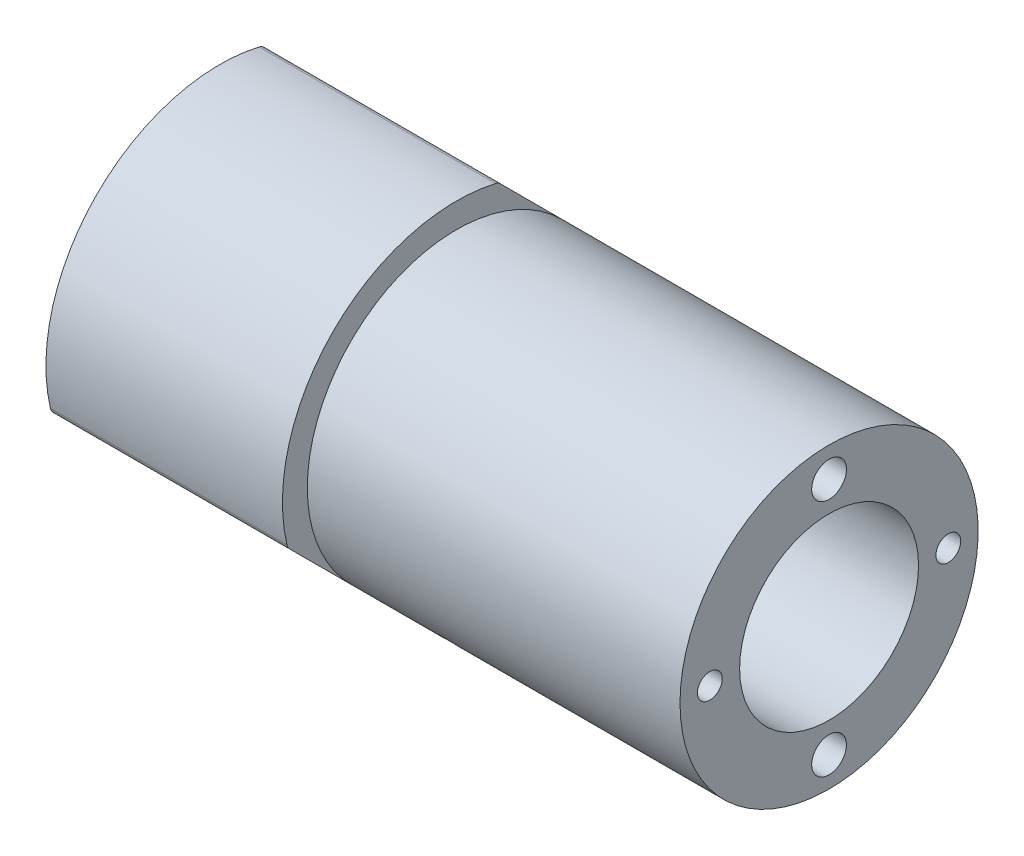
ISO-10303-21;
HEADER;
FILE_DESCRIPTION(('STEP AP214'),'2;1');
FILE_NAME('part.step','',(''),(''),'','','');
FILE_SCHEMA(('AUTOMOTIVE_DESIGN { 1 0 10303 214 1 1 1 1 }'));
ENDSEC;
DATA;
#1=APPLICATION_CONTEXT('core data for automotive mechanical design processes');
#2=APPLICATION_PROTOCOL_DEFINITION('international standard','automotive_design',2000,#1);
#3=PRODUCT_CONTEXT('',#1,'mechanical');
#4=PRODUCT('Part','Part','',(#3));
#5=PRODUCT_RELATED_PRODUCT_CATEGORY('part','',(#4));
#6=PRODUCT_DEFINITION_FORMATION('','',#4);
#7=PRODUCT_DEFINITION_CONTEXT('part definition',#1,'design');
#8=PRODUCT_DEFINITION('design','',#6,#7);
#9=PRODUCT_DEFINITION_SHAPE('','',#8);
#10=(LENGTH_UNIT() NAMED_UNIT(*) SI_UNIT(.MILLI.,.METRE.));
#11=(NAMED_UNIT(*) PLANE_ANGLE_UNIT() SI_UNIT($,.RADIAN.));
#12=(NAMED_UNIT(*) SI_UNIT($,.STERADIAN.) SOLID_ANGLE_UNIT());
#13=UNCERTAINTY_MEASURE_WITH_UNIT(LENGTH_MEASURE(1.E-05),#10,'distance_accuracy_value','');
#14=(GEOMETRIC_REPRESENTATION_CONTEXT(3) GLOBAL_UNCERTAINTY_ASSIGNED_CONTEXT((#13)) GLOBAL_UNIT_ASSIGNED_CONTEXT((#10,
#11,#12)) REPRESENTATION_CONTEXT('',''));
#15=CARTESIAN_POINT('',(0.,0.,0.));
#16=DIRECTION('',(0.,0.,1.));
#17=DIRECTION('',(1.,0.,0.));
#18=AXIS2_PLACEMENT_3D('',#15,#16,#17);
#19=CARTESIAN_POINT('',(227.370475165962,-148.573704322227,0.));
#20=DIRECTION('',(-1.,0.,0.));
#21=DIRECTION('',(0.,0.,1.));
#22=AXIS2_PLACEMENT_3D('',#19,#20,#21);
#23=CYLINDRICAL_SURFACE('',#22,9.00000000000001);
#24=CARTESIAN_POINT('',(259.301545348096,-148.573704322227,0.));
#25=DIRECTION('',(-1.,0.,0.));
#26=DIRECTION('',(0.,0.,1.));
#27=AXIS2_PLACEMENT_3D('',#24,#25,#26);
#28=CIRCLE('',#27,9.00000000000001);
#29=CARTESIAN_POINT('',(259.301545348096,-148.573704322227,9.00000000000001));
#30=VERTEX_POINT('',#29);
#31=EDGE_CURVE('E147',#30,#30,#28,.T.);
#32=ORIENTED_EDGE('',*,*,#31,.F.);
#33=EDGE_LOOP('',(#32));
#34=FACE_BOUND('',#33,.T.);
#35=CARTESIAN_POINT('',(208.551545348096,-148.573704322227,0.));
#36=DIRECTION('',(-1.,0.,0.));
#37=DIRECTION('',(0.,0.,1.));
#38=AXIS2_PLACEMENT_3D('',#35,#36,#37);
#39=CIRCLE('',#38,9.00000000000001);
#40=CARTESIAN_POINT('',(208.551545348096,-148.573704322227,9.00000000000001));
#41=VERTEX_POINT('',#40);
#42=EDGE_CURVE('E155',#41,#41,#39,.T.);
#43=ORIENTED_EDGE('',*,*,#42,.T.);
#44=EDGE_LOOP('',(#43));
#45=FACE_BOUND('',#44,.T.);
#46=CARTESIAN_POINT('',(231.801545348096,-155.60536642375,5.61744853915024));
#47=CARTESIAN_POINT('',(231.745561234619,-155.60536523312,5.61745075321373));
#48=CARTESIAN_POINT('',(231.689540948331,-155.602406556977,5.62115976932162));
#49=CARTESIAN_POINT('',(231.579056004039,-155.590618313197,5.63586758532295));
#50=CARTESIAN_POINT('',(231.524593089471,-155.581782415386,5.64687424524178));
#51=CARTESIAN_POINT('',(231.418838729071,-155.558409287387,5.67575894167251));
#52=CARTESIAN_POINT('',(231.367545288797,-155.543875685745,5.69363260483115));
#53=CARTESIAN_POINT('',(231.269542832449,-155.509386558681,5.73559465066902));
#54=CARTESIAN_POINT('',(231.222832961176,-155.489432047314,5.75968187097278));
#55=CARTESIAN_POINT('',(231.135105099005,-155.444398469707,5.81332862511097));
#56=CARTESIAN_POINT('',(231.094110434917,-155.419299378518,5.84290949904011));
#57=CARTESIAN_POINT('',(231.019177821142,-155.364538655035,5.90646467656285));
#58=CARTESIAN_POINT('',(230.985240205875,-155.334876806636,5.94043918823749));
#59=CARTESIAN_POINT('',(230.925302976794,-155.271555116257,6.01174439417106));
#60=CARTESIAN_POINT('',(230.899324229479,-155.237885080822,6.04908358416143));
#61=CARTESIAN_POINT('',(230.856175729996,-155.167405623669,6.12583174544058));
#62=CARTESIAN_POINT('',(230.83900571643,-155.130596295145,6.16524065527231));
#63=CARTESIAN_POINT('',(230.814031101485,-155.054936639023,6.24472771980938));
#64=CARTESIAN_POINT('',(230.806187952201,-155.016095409707,6.28480242089628));
#65=CARTESIAN_POINT('',(230.799970349444,-154.937292011474,6.36458126251163));
#66=CARTESIAN_POINT('',(230.801595597386,-154.897329877944,6.40428541468571));
#67=CARTESIAN_POINT('',(230.814237530487,-154.817617429417,6.48202406499678));
#68=CARTESIAN_POINT('',(230.825212762772,-154.777866957564,6.520065154843));
#69=CARTESIAN_POINT('',(230.856178447359,-154.699594755693,6.59366014809663));
#70=CARTESIAN_POINT('',(230.876169039929,-154.661073044803,6.62921401279619));
#71=CARTESIAN_POINT('',(230.924642863704,-154.586379271311,6.6970361412464));
#72=CARTESIAN_POINT('',(230.953144269252,-154.550212440785,6.72929717350871));
#73=CARTESIAN_POINT('',(231.017817463439,-154.481486493677,6.78971330449449));
#74=CARTESIAN_POINT('',(231.053989530077,-154.448927507914,6.81786825434407));
#75=CARTESIAN_POINT('',(231.133209989639,-154.388339860472,6.86961519220139));
#76=CARTESIAN_POINT('',(231.176294471368,-154.360336620559,6.89318171064714));
#77=CARTESIAN_POINT('',(231.267992110438,-154.310051556786,6.93508436603064));
#78=CARTESIAN_POINT('',(231.316605279214,-154.287769744759,6.95342049215116));
#79=CARTESIAN_POINT('',(231.418009834831,-154.249726793658,6.98450969025567));
#80=CARTESIAN_POINT('',(231.470802435655,-154.233967557513,6.99726113299871));
#81=CARTESIAN_POINT('',(231.579052355975,-154.209568609816,7.01692821180988));
#82=CARTESIAN_POINT('',(231.634509574649,-154.200928629121,7.02384406849225));
#83=CARTESIAN_POINT('',(231.746197794613,-154.191124030995,7.03168797246607));
#84=CARTESIAN_POINT('',(231.802423090392,-154.189919784123,7.03264776330683));
#85=CARTESIAN_POINT('',(231.914329261611,-154.19492688994,7.02864615072725));
#86=CARTESIAN_POINT('',(231.970010146155,-154.201138118418,7.02368484648715));
#87=CARTESIAN_POINT('',(232.079098090765,-154.220713655972,7.00795554659682));
#88=CARTESIAN_POINT('',(232.132510734434,-154.234059150897,6.99720282324517));
#89=CARTESIAN_POINT('',(232.235720033688,-154.267396228258,6.97010267030142));
#90=CARTESIAN_POINT('',(232.28551658773,-154.287387997239,6.95375508367391));
#91=CARTESIAN_POINT('',(232.380309494692,-154.333394760571,6.91569647154002));
#92=CARTESIAN_POINT('',(232.425284851565,-154.359434651327,6.89396325123847));
#93=CARTESIAN_POINT('',(232.508945216713,-154.416579084981,6.84559800884551));
#94=CARTESIAN_POINT('',(232.547630032307,-154.447683782957,6.81896583675064));
#95=CARTESIAN_POINT('',(232.617786590756,-154.514053654835,6.76122691475741));
#96=CARTESIAN_POINT('',(232.649225309735,-154.549336808923,6.73010069087644));
#97=CARTESIAN_POINT('',(232.703769476509,-154.622783957855,6.66416294608429));
#98=CARTESIAN_POINT('',(232.726875061415,-154.660947905288,6.62935148582086));
#99=CARTESIAN_POINT('',(232.764041712544,-154.738848803926,6.55696667863553));
#100=CARTESIAN_POINT('',(232.778122364099,-154.778582148875,6.51939951092606));
#101=CARTESIAN_POINT('',(232.796903288829,-154.858473553382,6.4424181228707));
#102=CARTESIAN_POINT('',(232.801603891946,-154.898631597952,6.40300396754194));
#103=CARTESIAN_POINT('',(232.801486016229,-154.977972268744,6.32364480901438));
#104=CARTESIAN_POINT('',(232.796718657309,-155.01715898285,6.28370380696488));
#105=CARTESIAN_POINT('',(232.777907829705,-155.093697403984,6.20425129508041));
#106=CARTESIAN_POINT('',(232.763864358863,-155.131049110584,6.16473978534545));
#107=CARTESIAN_POINT('',(232.726914926077,-155.20294531167,6.08736026010714));
#108=CARTESIAN_POINT('',(232.704010866684,-155.237490406868,6.04949189372723));
#109=CARTESIAN_POINT('',(232.649995756113,-155.30295711022,5.97658434740529));
#110=CARTESIAN_POINT('',(232.618884691455,-155.333878712423,5.94154517211039));
#111=CARTESIAN_POINT('',(232.549147899887,-155.391564335877,5.87526411868229));
#112=CARTESIAN_POINT('',(232.510484082397,-155.418305991522,5.84404285039469));
#113=CARTESIAN_POINT('',(232.426816683556,-155.46688487017,5.78666391032697));
#114=CARTESIAN_POINT('',(232.381811592129,-155.488720921755,5.76050744818525));
#115=CARTESIAN_POINT('',(232.286583758259,-155.527105673619,5.71411601254217));
#116=CARTESIAN_POINT('',(232.236345373767,-155.543637883224,5.6938995236583));
#117=CARTESIAN_POINT('',(232.132219629674,-155.570988472521,5.66025519704447));
#118=CARTESIAN_POINT('',(232.078336400461,-155.581813201558,5.64681981631628));
#119=CARTESIAN_POINT('',(231.987056410623,-155.594901647346,5.63052869919481));
#120=CARTESIAN_POINT('',(231.950240166936,-155.598822145224,5.62563217222459));
#121=CARTESIAN_POINT('',(231.876136416561,-155.604054922913,5.61909136352117));
#122=CARTESIAN_POINT('',(231.838848912472,-155.605367217096,5.61744706386637));
#123=CARTESIAN_POINT('',(231.801545348096,-155.60536642375,5.61744853915024));
#124=B_SPLINE_CURVE_WITH_KNOTS('',3,(#46,#47,#48,#49,#50,#51,#52,#53,#54,#55,#56,#57,#58,#59,
#60,#61,#62,#63,#64,#65,#66,#67,#68,#69,#70,#71,#72,#73,#74,#75,#76,#77,#78,#79,#80,#81,#82,#83,
#84,#85,#86,#87,#88,#89,#90,#91,#92,#93,#94,#95,#96,#97,#98,#99,#100,#101,#102,#103,#104,#105,
#106,#107,#108,#109,#110,#111,#112,#113,#114,#115,#116,#117,#118,#119,#120,#121,#122,#123),
.UNSPECIFIED.,.T.,.F.,(4,2,2,2,2,2,2,2,2,2,2,2,2,2,2,2,2,2,2,2,2,2,2,2,2,2,2,2,2,2,2,2,2,2,2,2,
2,2,4),(0.,0.167816094312495,0.335813231467333,0.503703554025065,0.671562491943652,
0.840087659677699,1.00862081162628,1.17759211396055,1.34655840179298,1.5148238980698,
1.68308408815946,1.85060216087686,2.01812284004198,2.1860038396258,2.35389092454429,
2.52268489532749,2.69147921519916,2.86032274533259,3.02915989205334,3.19709642315279,
3.36503014130096,3.53252316164427,3.70002088353093,3.86822070886242,4.03642568524667,
4.2053827266527,4.37433698797284,4.54292334295312,4.71150376785723,4.8791764590021,
5.04684918918841,5.21448593656708,5.38212295929422,5.55062832814458,5.71917389198528,
5.88823852910648,6.05711468959692,6.1689352148479,6.28075512390305),.UNSPECIFIED.);
#125=CARTESIAN_POINT('',(231.801545348096,-155.60536642375,5.61744853915024));
#126=VERTEX_POINT('',#125);
#127=EDGE_CURVE('E133',#126,#126,#124,.T.);
#128=ORIENTED_EDGE('',*,*,#127,.F.);
#129=EDGE_LOOP('',(#128));
#130=FACE_BOUND('',#129,.T.);
#131=ADVANCED_FACE('F36',(#34,#45,#130),#23,.F.);
#132=CARTESIAN_POINT('',(227.370475165962,-148.573704322227,0.));
#133=DIRECTION('',(-1.,0.,0.));
#134=DIRECTION('',(0.,0.,1.));
#135=AXIS2_PLACEMENT_3D('',#132,#133,#134);
#136=CYLINDRICAL_SURFACE('',#135,15.);
#137=CARTESIAN_POINT('',(221.801545348096,-148.573704322227,0.));
#138=DIRECTION('',(-1.,0.,0.));
#139=DIRECTION('',(0.,0.,1.));
#140=AXIS2_PLACEMENT_3D('',#137,#138,#139);
#141=CIRCLE('',#140,15.);
#142=CARTESIAN_POINT('',(221.801545348096,-137.967102604429,-10.6066017177982));
#143=VERTEX_POINT('',#142);
#144=CARTESIAN_POINT('',(221.801545348096,-159.180306040025,10.6066017177983));
#145=VERTEX_POINT('',#144);
#146=EDGE_CURVE('E124',#143,#145,#141,.T.);
#147=ORIENTED_EDGE('',*,*,#146,.F.);
#148=EDGE_CURVE('E135',#145,#143,#141,.T.);
#149=ORIENTED_EDGE('',*,*,#148,.F.);
#150=EDGE_LOOP('',(#147,#149));
#151=FACE_BOUND('',#150,.T.);
#152=CARTESIAN_POINT('',(259.301545348096,-148.573704322227,0.));
#153=DIRECTION('',(-1.,0.,0.));
#154=DIRECTION('',(0.,0.,1.));
#155=AXIS2_PLACEMENT_3D('',#152,#153,#154);
#156=CIRCLE('',#155,15.);
#157=CARTESIAN_POINT('',(259.301545348096,-148.573704322227,15.));
#158=VERTEX_POINT('',#157);
#159=EDGE_CURVE('E145',#158,#158,#156,.T.);
#160=ORIENTED_EDGE('',*,*,#159,.T.);
#161=EDGE_LOOP('',(#160));
#162=FACE_BOUND('',#161,.T.);
#163=CARTESIAN_POINT('',(231.801545348096,-159.863816347672,9.87589846307187));
#164=CARTESIAN_POINT('',(231.857648782675,-159.863814919316,9.87590052172793));
#165=CARTESIAN_POINT('',(231.913791308216,-159.860692061514,9.87947367749882));
#166=CARTESIAN_POINT('',(232.024525566104,-159.848260834343,9.8936576125694));
#167=CARTESIAN_POINT('',(232.079115425381,-159.83894529911,9.90427654487056));
#168=CARTESIAN_POINT('',(232.185124357026,-159.81434249053,9.93218997274158));
#169=CARTESIAN_POINT('',(232.236545108031,-159.799058410678,9.94948089837368));
#170=CARTESIAN_POINT('',(232.334777158524,-159.762873127476,9.99015709858705));
#171=CARTESIAN_POINT('',(232.381589497764,-159.741973195165,10.0135409941064));
#172=CARTESIAN_POINT('',(232.469368310265,-159.695006253977,10.065677948239));
#173=CARTESIAN_POINT('',(232.510325945678,-159.668931572446,10.0944389758679));
#174=CARTESIAN_POINT('',(232.585157013398,-159.61225694805,10.1563829432925));
#175=CARTESIAN_POINT('',(232.619030147775,-159.581656814964,10.189566068959));
#176=CARTESIAN_POINT('',(232.678758273044,-159.516656703301,10.2593403863135));
#177=CARTESIAN_POINT('',(232.704605890015,-159.482253269333,10.2959346723118));
#178=CARTESIAN_POINT('',(232.747502058877,-159.410552186902,10.3713756872603));
#179=CARTESIAN_POINT('',(232.764550715526,-159.373254572903,10.4102223893872));
#180=CARTESIAN_POINT('',(232.78934032389,-159.296818142623,10.4889386295473));
#181=CARTESIAN_POINT('',(232.79709520347,-159.25768217305,10.5288065453469));
#182=CARTESIAN_POINT('',(232.803120144596,-159.178600543232,10.6084553576025));
#183=CARTESIAN_POINT('',(232.80139032538,-159.138654893174,10.648236255146));
#184=CARTESIAN_POINT('',(232.78850644284,-159.059161986195,10.7265225305829));
#185=CARTESIAN_POINT('',(232.777367360678,-159.019614197041,10.7650298350368));
#186=CARTESIAN_POINT('',(232.746004406274,-158.942016730764,10.8397879318341));
#187=CARTESIAN_POINT('',(232.72578047443,-158.903967063472,10.8760387093717));
#188=CARTESIAN_POINT('',(232.67680498715,-158.830486501923,10.9453632031899));
#189=CARTESIAN_POINT('',(232.64804665669,-158.79505771627,10.9784343676177));
#190=CARTESIAN_POINT('',(232.582823642301,-158.727949225982,11.040534591177));
#191=CARTESIAN_POINT('',(232.546358859304,-158.696269569551,11.0695635983376));
#192=CARTESIAN_POINT('',(232.466673461717,-158.637605212215,11.1229257822552));
#193=CARTESIAN_POINT('',(232.423439841458,-158.61062976541,11.1472497132431));
#194=CARTESIAN_POINT('',(232.331489535526,-158.562325313206,11.190554342132));
#195=CARTESIAN_POINT('',(232.282772847334,-158.5409963104,11.2095350375784));
#196=CARTESIAN_POINT('',(232.181230824317,-158.50469009055,11.2417130864283));
#197=CARTESIAN_POINT('',(232.12840521511,-158.48971329812,11.2549100532192));
#198=CARTESIAN_POINT('',(232.020148787993,-158.46661885872,11.2752153189393));
#199=CARTESIAN_POINT('',(231.96471800499,-158.458501119874,11.2823236994248));
#200=CARTESIAN_POINT('',(231.852938877459,-158.449410335787,11.2902820129301));
#201=CARTESIAN_POINT('',(231.796592503437,-158.448423574674,11.2911439604799));
#202=CARTESIAN_POINT('',(231.684481309733,-158.453592170793,11.2866216129746));
#203=CARTESIAN_POINT('',(231.628716486605,-158.459747485664,11.2812373549674));
#204=CARTESIAN_POINT('',(231.519402941885,-158.478981535308,11.2643528514879));
#205=CARTESIAN_POINT('',(231.465852249382,-158.492053963239,11.2528581772886));
#206=CARTESIAN_POINT('',(231.362426201206,-158.524678326669,11.224018337837));
#207=CARTESIAN_POINT('',(231.312550883455,-158.544230329012,11.2066731122305));
#208=CARTESIAN_POINT('',(231.217807844042,-158.589200697391,11.1665007649795));
#209=CARTESIAN_POINT('',(231.172947876672,-158.614627966092,11.1436653219775));
#210=CARTESIAN_POINT('',(231.08958710743,-158.670504306139,11.0930630141252));
#211=CARTESIAN_POINT('',(231.051086376145,-158.70095343322,11.0652960945427));
#212=CARTESIAN_POINT('',(230.981475402656,-158.7659540069,11.0054530700411));
#213=CARTESIAN_POINT('',(230.950376942498,-158.800511863928,10.9733702208917));
#214=CARTESIAN_POINT('',(230.896533943612,-158.872609195292,10.9057323627934));
#215=CARTESIAN_POINT('',(230.873789347618,-158.910148649187,10.8701773776491));
#216=CARTESIAN_POINT('',(230.837320161063,-158.987028650859,10.7965505881795));
#217=CARTESIAN_POINT('',(230.823588144129,-159.026367687111,10.7584808845303));
#218=CARTESIAN_POINT('',(230.805509619114,-159.105702895424,10.6808279509854));
#219=CARTESIAN_POINT('',(230.801163003604,-159.145699059959,10.6412447384194));
#220=CARTESIAN_POINT('',(230.801979739182,-159.225113393356,10.5617534169641));
#221=CARTESIAN_POINT('',(230.807124665644,-159.264532532629,10.5218460869282));
#222=CARTESIAN_POINT('',(230.826740198805,-159.341773137813,10.4427845663461));
#223=CARTESIAN_POINT('',(230.841210821357,-159.379594601008,10.4036303770803));
#224=CARTESIAN_POINT('',(230.879062715478,-159.452623942016,10.3272407976396));
#225=CARTESIAN_POINT('',(230.902443860703,-159.487831856877,10.2900053802668));
#226=CARTESIAN_POINT('',(230.957450653349,-159.554725942521,10.2185890007295));
#227=CARTESIAN_POINT('',(230.989076101832,-159.586412198256,10.1844079648883));
#228=CARTESIAN_POINT('',(231.059742198605,-159.645531728681,10.1201063453899));
#229=CARTESIAN_POINT('',(231.098796252623,-159.672957149121,10.0899932734723));
#230=CARTESIAN_POINT('',(231.18319130985,-159.722830750991,10.0348575458179));
#231=CARTESIAN_POINT('',(231.228533846359,-159.745277715062,10.0098361352459));
#232=CARTESIAN_POINT('',(231.324276881557,-159.784684588279,9.96568117261271));
#233=CARTESIAN_POINT('',(231.374684129981,-159.801637044357,9.94655561973676));
#234=CARTESIAN_POINT('',(231.479040445631,-159.829606018268,9.91489422342326));
#235=CARTESIAN_POINT('',(231.532985294873,-159.840629466083,9.90235068717121));
#236=CARTESIAN_POINT('',(231.622972688049,-159.85363872875,9.88752419846842));
#237=CARTESIAN_POINT('',(231.658434035548,-159.857451242859,9.88317107959203));
#238=CARTESIAN_POINT('',(231.729773371586,-159.862540507201,9.87735755567225));
#239=CARTESIAN_POINT('',(231.765651359456,-159.863817261509,9.87589714598));
#240=CARTESIAN_POINT('',(231.801545348096,-159.863816347672,9.87589846307187));
#241=B_SPLINE_CURVE_WITH_KNOTS('',3,(#163,#164,#165,#166,#167,#168,#169,#170,#171,#172,#173,
#174,#175,#176,#177,#178,#179,#180,#181,#182,#183,#184,#185,#186,#187,#188,#189,#190,#191,#192,
#193,#194,#195,#196,#197,#198,#199,#200,#201,#202,#203,#204,#205,#206,#207,#208,#209,#210,#211,
#212,#213,#214,#215,#216,#217,#218,#219,#220,#221,#222,#223,#224,#225,#226,#227,#228,#229,#230,
#231,#232,#233,#234,#235,#236,#237,#238,#239,#240),.UNSPECIFIED.,.T.,.F.,(4,2,2,2,2,2,2,2,2,2,2,
2,2,2,2,2,2,2,2,2,2,2,2,2,2,2,2,2,2,2,2,2,2,2,2,2,2,2,4),(0.,0.16817926484095,0.336553478053452,
0.504837725074759,0.673083916253139,0.841581457072487,1.01008608245695,1.1787450764179,
1.34740206229269,1.51580597764018,1.68420777586517,1.85234195379501,2.02047723479458,
2.18874634851119,2.35701762550342,2.52561627976711,2.6942150114844,2.86282501143769,
3.03143275283048,3.19971610400743,3.36799845705999,3.53612763840645,3.70425855422667,
3.87264592558118,4.04103516590926,4.20969066206903,4.37834500202404,4.54686019555955,
4.71537346017785,4.88355995728438,5.05174674029588,5.21993113867105,5.38811147907858,
5.55659824911517,5.72512617317098,5.89388175069686,6.06243965122597,6.17003795369026,
6.27763608323366),.UNSPECIFIED.);
#242=CARTESIAN_POINT('',(231.801545348096,-159.863816347672,9.87589846307187));
#243=VERTEX_POINT('',#242);
#244=EDGE_CURVE('E336',#243,#243,#241,.T.);
#245=ORIENTED_EDGE('',*,*,#244,.F.);
#246=EDGE_LOOP('',(#245));
#247=FACE_BOUND('',#246,.T.);
#248=ADVANCED_FACE('F143',(#151,#162,#247),#136,.T.);
#249=CARTESIAN_POINT('',(221.801545348096,0.,0.));
#250=DIRECTION('',(1.,0.,0.));
#251=DIRECTION('',(0.,0.,-1.));
#252=AXIS2_PLACEMENT_3D('',#249,#250,#251);
#253=PLANE('',#252);
#254=DIRECTION('',(0.,-0.707106781186551,-0.707106781186544));
#255=VECTOR('',#254,1.);
#256=CARTESIAN_POINT('',(221.801545348096,-165.554080432016,4.23282732580721));
#257=LINE('',#256,#255);
#258=CARTESIAN_POINT('',(221.801545348096,-165.354850557639,4.43205720018408));
#259=VERTEX_POINT('',#258);
#260=EDGE_CURVE('E213',#145,#259,#257,.T.);
#261=ORIENTED_EDGE('',*,*,#260,.T.);
#262=CARTESIAN_POINT('',(221.801545348096,-164.647743776453,3.72495041899753));
#263=DIRECTION('',(1.,0.,0.));
#264=DIRECTION('',(0.,0.,-1.));
#265=AXIS2_PLACEMENT_3D('',#262,#263,#264);
#266=CIRCLE('',#265,1.);
#267=CARTESIAN_POINT('',(221.801545348096,-165.6219279858,3.95070498984586));
#268=VERTEX_POINT('',#267);
#269=EDGE_CURVE('E196',#259,#268,#266,.T.);
#270=ORIENTED_EDGE('',*,*,#269,.T.);
#271=CARTESIAN_POINT('',(221.801545348096,-148.573704322227,0.));
#272=DIRECTION('',(-1.,0.,0.));
#273=DIRECTION('',(0.,0.,1.));
#274=AXIS2_PLACEMENT_3D('',#271,#272,#273);
#275=CIRCLE('',#274,17.5);
#276=CARTESIAN_POINT('',(221.801545348096,-144.622999332381,-17.0482236635729));
#277=VERTEX_POINT('',#276);
#278=EDGE_CURVE('E176',#277,#268,#275,.T.);
#279=ORIENTED_EDGE('',*,*,#278,.F.);
#280=CARTESIAN_POINT('',(221.801545348096,-144.84875390323,-16.0740394542259));
#281=DIRECTION('',(1.,0.,0.));
#282=DIRECTION('',(0.,0.,-1.));
#283=AXIS2_PLACEMENT_3D('',#280,#281,#282);
#284=CIRCLE('',#283,1.);
#285=CARTESIAN_POINT('',(221.801545348096,-144.141647122043,-16.7811462354125));
#286=VERTEX_POINT('',#285);
#287=EDGE_CURVE('E126',#277,#286,#284,.T.);
#288=ORIENTED_EDGE('',*,*,#287,.T.);
#289=DIRECTION('',(0.,0.707106781186548,0.707106781186547));
#290=VECTOR('',#289,1.);
#291=CARTESIAN_POINT('',(221.801545348096,-144.34087699642,-16.9803761097893));
#292=LINE('',#291,#290);
#293=EDGE_CURVE('E120',#286,#143,#292,.T.);
#294=ORIENTED_EDGE('',*,*,#293,.T.);
#295=ORIENTED_EDGE('',*,*,#146,.T.);
#296=EDGE_LOOP('',(#261,#270,#279,#288,#294,#295));
#297=FACE_BOUND('',#296,.T.);
#298=ADVANCED_FACE('F122',(#297),#253,.T.);
#299=CARTESIAN_POINT('',(227.370475165962,-148.573704322227,0.));
#300=DIRECTION('',(-1.,0.,0.));
#301=DIRECTION('',(0.,0.,1.));
#302=AXIS2_PLACEMENT_3D('',#299,#300,#301);
#303=CYLINDRICAL_SURFACE('',#302,17.5);
#304=ORIENTED_EDGE('',*,*,#278,.T.);
#305=DIRECTION('',(-1.,0.,0.));
#306=VECTOR('',#305,1.);
#307=CARTESIAN_POINT('',(227.370475165962,-165.6219279858,3.95070498984586));
#308=LINE('',#307,#306);
#309=CARTESIAN_POINT('',(198.001545348096,-165.6219279858,3.95070498984586));
#310=VERTEX_POINT('',#309);
#311=EDGE_CURVE('E180',#268,#310,#308,.T.);
#312=ORIENTED_EDGE('',*,*,#311,.T.);
#313=CARTESIAN_POINT('',(198.001545348096,-148.573704322227,0.));
#314=DIRECTION('',(-1.,0.,0.));
#315=DIRECTION('',(0.,0.,1.));
#316=AXIS2_PLACEMENT_3D('',#313,#314,#315);
#317=CIRCLE('',#316,17.5);
#318=CARTESIAN_POINT('',(198.001545348096,-144.622999332381,-17.0482236635729));
#319=VERTEX_POINT('',#318);
#320=EDGE_CURVE('E173',#319,#310,#317,.T.);
#321=ORIENTED_EDGE('',*,*,#320,.F.);
#322=DIRECTION('',(-1.,0.,0.));
#323=VECTOR('',#322,1.);
#324=CARTESIAN_POINT('',(227.370475165962,-144.622999332381,-17.0482236635729));
#325=LINE('',#324,#323);
#326=EDGE_CURVE('E177',#319,#277,#325,.F.);
#327=ORIENTED_EDGE('',*,*,#326,.T.);
#328=EDGE_LOOP('',(#304,#312,#321,#327));
#329=FACE_BOUND('',#328,.T.);
#330=ADVANCED_FACE('F313',(#329),#303,.T.);
#331=CARTESIAN_POINT('',(221.801545348096,-152.524409312073,17.048223663573));
#332=VERTEX_POINT('',#331);
#333=CARTESIAN_POINT('',(221.801545348096,-131.525480658654,-3.95070498984578));
#334=VERTEX_POINT('',#333);
#335=EDGE_CURVE('E174',#332,#334,#275,.T.);
#336=ORIENTED_EDGE('',*,*,#335,.F.);
#337=CARTESIAN_POINT('',(221.801545348096,-152.298654741224,16.0740394542259));
#338=DIRECTION('',(1.,0.,0.));
#339=DIRECTION('',(0.,0.,-1.));
#340=AXIS2_PLACEMENT_3D('',#337,#338,#339);
#341=CIRCLE('',#340,1.);
#342=CARTESIAN_POINT('',(221.801545348096,-153.005761522411,16.7811462354125));
#343=VERTEX_POINT('',#342);
#344=EDGE_CURVE('E205',#332,#343,#341,.T.);
#345=ORIENTED_EDGE('',*,*,#344,.T.);
#346=EDGE_CURVE('E138',#343,#145,#257,.T.);
#347=ORIENTED_EDGE('',*,*,#346,.T.);
#348=ORIENTED_EDGE('',*,*,#148,.T.);
#349=CARTESIAN_POINT('',(221.801545348096,-131.792558086815,-4.43205720018399));
#350=VERTEX_POINT('',#349);
#351=EDGE_CURVE('E129',#143,#350,#292,.T.);
#352=ORIENTED_EDGE('',*,*,#351,.T.);
#353=CARTESIAN_POINT('',(221.801545348096,-132.499664868001,-3.72495041899746));
#354=DIRECTION('',(1.,0.,0.));
#355=DIRECTION('',(0.,0.,-1.));
#356=AXIS2_PLACEMENT_3D('',#353,#354,#355);
#357=CIRCLE('',#356,1.);
#358=EDGE_CURVE('E57',#350,#334,#357,.T.);
#359=ORIENTED_EDGE('',*,*,#358,.T.);
#360=EDGE_LOOP('',(#336,#345,#347,#348,#352,#359));
#361=FACE_BOUND('',#360,.T.);
#362=ADVANCED_FACE('F136',(#361),#253,.T.);
#363=CARTESIAN_POINT('',(198.001545348096,-152.524409312073,17.048223663573));
#364=VERTEX_POINT('',#363);
#365=CARTESIAN_POINT('',(198.001545348096,-131.525480658654,-3.95070498984578));
#366=VERTEX_POINT('',#365);
#367=EDGE_CURVE('E170',#364,#366,#317,.T.);
#368=ORIENTED_EDGE('',*,*,#367,.F.);
#369=DIRECTION('',(-1.,0.,0.));
#370=VECTOR('',#369,1.);
#371=CARTESIAN_POINT('',(227.370475165962,-152.524409312073,17.048223663573));
#372=LINE('',#371,#370);
#373=EDGE_CURVE('E201',#364,#332,#372,.F.);
#374=ORIENTED_EDGE('',*,*,#373,.T.);
#375=ORIENTED_EDGE('',*,*,#335,.T.);
#376=DIRECTION('',(-1.,0.,0.));
#377=VECTOR('',#376,1.);
#378=CARTESIAN_POINT('',(227.370475165962,-131.525480658654,-3.95070498984579));
#379=LINE('',#378,#377);
#380=EDGE_CURVE('E198',#334,#366,#379,.T.);
#381=ORIENTED_EDGE('',*,*,#380,.T.);
#382=EDGE_LOOP('',(#368,#374,#375,#381));
#383=FACE_BOUND('',#382,.T.);
#384=ADVANCED_FACE('F224',(#383),#303,.T.);
#385=CARTESIAN_POINT('',(198.001545348096,0.,0.));
#386=DIRECTION('',(-1.,0.,0.));
#387=DIRECTION('',(0.,0.,1.));
#388=AXIS2_PLACEMENT_3D('',#385,#386,#387);
#389=PLANE('',#388);
#390=ORIENTED_EDGE('',*,*,#320,.T.);
#391=CARTESIAN_POINT('',(198.001545348096,-164.647743776453,3.72495041899753));
#392=DIRECTION('',(-1.,0.,0.));
#393=DIRECTION('',(0.,0.,1.));
#394=AXIS2_PLACEMENT_3D('',#391,#392,#393);
#395=CIRCLE('',#394,1.);
#396=CARTESIAN_POINT('',(198.001545348096,-165.354850557639,4.43205720018408));
#397=VERTEX_POINT('',#396);
#398=EDGE_CURVE('E189',#310,#397,#395,.T.);
#399=ORIENTED_EDGE('',*,*,#398,.T.);
#400=DIRECTION('',(0.,-0.707106781186551,-0.707106781186544));
#401=VECTOR('',#400,1.);
#402=CARTESIAN_POINT('',(198.001545348096,-165.554080432016,4.23282732580721));
#403=LINE('',#402,#401);
#404=CARTESIAN_POINT('',(198.001545348096,-153.005761522411,16.7811462354125));
#405=VERTEX_POINT('',#404);
#406=EDGE_CURVE('E214',#405,#397,#403,.T.);
#407=ORIENTED_EDGE('',*,*,#406,.F.);
#408=CARTESIAN_POINT('',(198.001545348096,-152.298654741224,16.0740394542259));
#409=DIRECTION('',(-1.,0.,0.));
#410=DIRECTION('',(0.,0.,1.));
#411=AXIS2_PLACEMENT_3D('',#408,#409,#410);
#412=CIRCLE('',#411,1.);
#413=EDGE_CURVE('E187',#405,#364,#412,.T.);
#414=ORIENTED_EDGE('',*,*,#413,.T.);
#415=ORIENTED_EDGE('',*,*,#367,.T.);
#416=CARTESIAN_POINT('',(198.001545348096,-132.499664868001,-3.72495041899746));
#417=DIRECTION('',(-1.,0.,0.));
#418=DIRECTION('',(0.,0.,1.));
#419=AXIS2_PLACEMENT_3D('',#416,#417,#418);
#420=CIRCLE('',#419,1.);
#421=CARTESIAN_POINT('',(198.001545348096,-131.792558086815,-4.43205720018399));
#422=VERTEX_POINT('',#421);
#423=EDGE_CURVE('E183',#366,#422,#420,.T.);
#424=ORIENTED_EDGE('',*,*,#423,.T.);
#425=DIRECTION('',(0.,0.707106781186548,0.707106781186547));
#426=VECTOR('',#425,1.);
#427=CARTESIAN_POINT('',(198.001545348096,-144.34087699642,-16.9803761097893));
#428=LINE('',#427,#426);
#429=CARTESIAN_POINT('',(198.001545348096,-144.141647122043,-16.7811462354125));
#430=VERTEX_POINT('',#429);
#431=EDGE_CURVE('E128',#430,#422,#428,.T.);
#432=ORIENTED_EDGE('',*,*,#431,.F.);
#433=CARTESIAN_POINT('',(198.001545348096,-144.84875390323,-16.0740394542259));
#434=DIRECTION('',(-1.,0.,0.));
#435=DIRECTION('',(0.,0.,1.));
#436=AXIS2_PLACEMENT_3D('',#433,#434,#435);
#437=CIRCLE('',#436,1.);
#438=EDGE_CURVE('E185',#430,#319,#437,.T.);
#439=ORIENTED_EDGE('',*,*,#438,.T.);
#440=EDGE_LOOP('',(#390,#399,#407,#414,#415,#424,#432,#439));
#441=FACE_BOUND('',#440,.T.);
#442=CARTESIAN_POINT('',(198.001545348096,-148.573704322227,-12.));
#443=DIRECTION('',(-1.,0.,0.));
#444=DIRECTION('',(0.,0.,1.));
#445=AXIS2_PLACEMENT_3D('',#442,#443,#444);
#446=CIRCLE('',#445,2.5);
#447=CARTESIAN_POINT('',(198.001545348096,-148.573704322227,-9.5));
#448=VERTEX_POINT('',#447);
#449=EDGE_CURVE('E232',#448,#448,#446,.T.);
#450=ORIENTED_EDGE('',*,*,#449,.F.);
#451=EDGE_LOOP('',(#450));
#452=FACE_BOUND('',#451,.T.);
#453=CARTESIAN_POINT('',(198.001545348096,-148.573704322227,12.));
#454=DIRECTION('',(-1.,0.,0.));
#455=DIRECTION('',(0.,0.,1.));
#456=AXIS2_PLACEMENT_3D('',#453,#454,#455);
#457=CIRCLE('',#456,2.5);
#458=CARTESIAN_POINT('',(198.001545348096,-148.573704322227,14.5));
#459=VERTEX_POINT('',#458);
#460=EDGE_CURVE('E238',#459,#459,#457,.T.);
#461=ORIENTED_EDGE('',*,*,#460,.F.);
#462=EDGE_LOOP('',(#461));
#463=FACE_BOUND('',#462,.T.);
#464=CARTESIAN_POINT('',(198.001545348096,-136.573704322227,0.));
#465=DIRECTION('',(-1.,0.,0.));
#466=DIRECTION('',(0.,0.,1.));
#467=AXIS2_PLACEMENT_3D('',#464,#465,#466);
#468=CIRCLE('',#467,1.75);
#469=CARTESIAN_POINT('',(198.001545348096,-136.573704322227,1.75));
#470=VERTEX_POINT('',#469);
#471=EDGE_CURVE('E258',#470,#470,#468,.F.);
#472=ORIENTED_EDGE('',*,*,#471,.T.);
#473=EDGE_LOOP('',(#472));
#474=FACE_BOUND('',#473,.T.);
#475=CARTESIAN_POINT('',(198.001545348096,-160.573704322227,0.));
#476=DIRECTION('',(-1.,0.,0.));
#477=DIRECTION('',(0.,0.,1.));
#478=AXIS2_PLACEMENT_3D('',#475,#476,#477);
#479=CIRCLE('',#478,1.75);
#480=CARTESIAN_POINT('',(198.001545348096,-160.573704322227,1.75));
#481=VERTEX_POINT('',#480);
#482=EDGE_CURVE('E150',#481,#481,#479,.F.);
#483=ORIENTED_EDGE('',*,*,#482,.T.);
#484=EDGE_LOOP('',(#483));
#485=FACE_BOUND('',#484,.T.);
#486=CARTESIAN_POINT('',(198.001545348096,-148.573704322227,0.));
#487=DIRECTION('',(-1.,0.,0.));
#488=DIRECTION('',(0.,0.,1.));
#489=AXIS2_PLACEMENT_3D('',#486,#487,#488);
#490=CIRCLE('',#489,3.37499999999999);
#491=CARTESIAN_POINT('',(198.001545348096,-148.573704322227,3.37499999999999));
#492=VERTEX_POINT('',#491);
#493=EDGE_CURVE('E167',#492,#492,#490,.T.);
#494=ORIENTED_EDGE('',*,*,#493,.F.);
#495=EDGE_LOOP('',(#494));
#496=FACE_BOUND('',#495,.T.);
#497=ADVANCED_FACE('F221',(#441,#452,#463,#474,#485,#496),#389,.T.);
#498=CARTESIAN_POINT('',(227.370475165962,-148.573704322227,0.));
#499=DIRECTION('',(-1.,0.,0.));
#500=DIRECTION('',(0.,0.,1.));
#501=AXIS2_PLACEMENT_3D('',#498,#499,#500);
#502=CYLINDRICAL_SURFACE('',#501,3.37499999999999);
#503=ORIENTED_EDGE('',*,*,#493,.T.);
#504=EDGE_LOOP('',(#503));
#505=FACE_BOUND('',#504,.T.);
#506=CARTESIAN_POINT('',(205.151545348096,-148.573704322227,0.));
#507=DIRECTION('',(-1.,0.,0.));
#508=DIRECTION('',(0.,0.,1.));
#509=AXIS2_PLACEMENT_3D('',#506,#507,#508);
#510=CIRCLE('',#509,3.37499999999999);
#511=CARTESIAN_POINT('',(205.151545348096,-148.573704322227,3.37499999999999));
#512=VERTEX_POINT('',#511);
#513=EDGE_CURVE('E164',#512,#512,#510,.T.);
#514=ORIENTED_EDGE('',*,*,#513,.F.);
#515=EDGE_LOOP('',(#514));
#516=FACE_BOUND('',#515,.T.);
#517=ADVANCED_FACE('F304',(#505,#516),#502,.F.);
#518=CARTESIAN_POINT('',(205.151545348096,0.,0.));
#519=DIRECTION('',(-1.,0.,0.));
#520=DIRECTION('',(0.,0.,1.));
#521=AXIS2_PLACEMENT_3D('',#518,#519,#520);
#522=PLANE('',#521);
#523=CARTESIAN_POINT('',(205.151545348096,-148.573704322227,0.));
#524=DIRECTION('',(-1.,0.,0.));
#525=DIRECTION('',(0.,0.,1.));
#526=AXIS2_PLACEMENT_3D('',#523,#524,#525);
#527=CIRCLE('',#526,8.00000000000001);
#528=CARTESIAN_POINT('',(205.151545348096,-148.573704322227,8.00000000000001));
#529=VERTEX_POINT('',#528);
#530=EDGE_CURVE('E161',#529,#529,#527,.T.);
#531=ORIENTED_EDGE('',*,*,#530,.F.);
#532=EDGE_LOOP('',(#531));
#533=FACE_BOUND('',#532,.T.);
#534=ORIENTED_EDGE('',*,*,#513,.T.);
#535=EDGE_LOOP('',(#534));
#536=FACE_BOUND('',#535,.T.);
#537=ADVANCED_FACE('F300',(#533,#536),#522,.F.);
#538=CARTESIAN_POINT('',(227.370475165962,-148.573704322227,0.));
#539=DIRECTION('',(-1.,0.,0.));
#540=DIRECTION('',(0.,0.,1.));
#541=AXIS2_PLACEMENT_3D('',#538,#539,#540);
#542=CYLINDRICAL_SURFACE('',#541,8.00000000000001);
#543=CARTESIAN_POINT('',(208.551545348096,-148.573704322227,0.));
#544=DIRECTION('',(-1.,0.,0.));
#545=DIRECTION('',(0.,0.,1.));
#546=AXIS2_PLACEMENT_3D('',#543,#544,#545);
#547=CIRCLE('',#546,8.00000000000001);
#548=CARTESIAN_POINT('',(208.551545348096,-148.573704322227,8.00000000000001));
#549=VERTEX_POINT('',#548);
#550=EDGE_CURVE('E158',#549,#549,#547,.T.);
#551=ORIENTED_EDGE('',*,*,#550,.F.);
#552=EDGE_LOOP('',(#551));
#553=FACE_BOUND('',#552,.T.);
#554=ORIENTED_EDGE('',*,*,#530,.T.);
#555=EDGE_LOOP('',(#554));
#556=FACE_BOUND('',#555,.T.);
#557=ADVANCED_FACE('F296',(#553,#556),#542,.F.);
#558=CARTESIAN_POINT('',(208.551545348096,0.,0.));
#559=DIRECTION('',(1.,0.,0.));
#560=DIRECTION('',(0.,0.,-1.));
#561=AXIS2_PLACEMENT_3D('',#558,#559,#560);
#562=PLANE('',#561);
#563=ORIENTED_EDGE('',*,*,#550,.T.);
#564=EDGE_LOOP('',(#563));
#565=FACE_BOUND('',#564,.T.);
#566=ORIENTED_EDGE('',*,*,#42,.F.);
#567=EDGE_LOOP('',(#566));
#568=FACE_BOUND('',#567,.T.);
#569=ADVANCED_FACE('F281',(#565,#568),#562,.T.);
#570=CARTESIAN_POINT('',(259.301545348096,0.,0.));
#571=DIRECTION('',(1.,0.,0.));
#572=DIRECTION('',(0.,0.,-1.));
#573=AXIS2_PLACEMENT_3D('',#570,#571,#572);
#574=PLANE('',#573);
#575=CARTESIAN_POINT('',(259.301545348096,-148.573704322227,12.));
#576=DIRECTION('',(1.,0.,0.));
#577=DIRECTION('',(0.,0.,-1.));
#578=AXIS2_PLACEMENT_3D('',#575,#576,#577);
#579=CIRCLE('',#578,1.25);
#580=CARTESIAN_POINT('',(259.301545348096,-148.573704322227,10.75));
#581=VERTEX_POINT('',#580);
#582=EDGE_CURVE('E244',#581,#581,#579,.T.);
#583=ORIENTED_EDGE('',*,*,#582,.F.);
#584=EDGE_LOOP('',(#583));
#585=FACE_BOUND('',#584,.T.);
#586=CARTESIAN_POINT('',(259.301545348096,-148.573704322227,-12.));
#587=DIRECTION('',(1.,0.,0.));
#588=DIRECTION('',(0.,0.,-1.));
#589=AXIS2_PLACEMENT_3D('',#586,#587,#588);
#590=CIRCLE('',#589,1.25);
#591=CARTESIAN_POINT('',(259.301545348096,-148.573704322227,-13.25));
#592=VERTEX_POINT('',#591);
#593=EDGE_CURVE('E250',#592,#592,#590,.T.);
#594=ORIENTED_EDGE('',*,*,#593,.F.);
#595=EDGE_LOOP('',(#594));
#596=FACE_BOUND('',#595,.T.);
#597=CARTESIAN_POINT('',(259.301545348096,-136.573704322227,0.));
#598=DIRECTION('',(1.,0.,0.));
#599=DIRECTION('',(0.,0.,-1.));
#600=AXIS2_PLACEMENT_3D('',#597,#598,#599);
#601=CIRCLE('',#600,1.75);
#602=CARTESIAN_POINT('',(259.301545348096,-136.573704322227,-1.75));
#603=VERTEX_POINT('',#602);
#604=EDGE_CURVE('E141',#603,#603,#601,.T.);
#605=ORIENTED_EDGE('',*,*,#604,.F.);
#606=EDGE_LOOP('',(#605));
#607=FACE_BOUND('',#606,.T.);
#608=CARTESIAN_POINT('',(259.301545348096,-160.573704322227,0.));
#609=DIRECTION('',(1.,0.,0.));
#610=DIRECTION('',(0.,0.,-1.));
#611=AXIS2_PLACEMENT_3D('',#608,#609,#610);
#612=CIRCLE('',#611,1.75);
#613=CARTESIAN_POINT('',(259.301545348096,-160.573704322227,-1.75));
#614=VERTEX_POINT('',#613);
#615=EDGE_CURVE('E260',#614,#614,#612,.T.);
#616=ORIENTED_EDGE('',*,*,#615,.F.);
#617=EDGE_LOOP('',(#616));
#618=FACE_BOUND('',#617,.T.);
#619=ORIENTED_EDGE('',*,*,#31,.T.);
#620=EDGE_LOOP('',(#619));
#621=FACE_BOUND('',#620,.T.);
#622=ORIENTED_EDGE('',*,*,#159,.F.);
#623=EDGE_LOOP('',(#622));
#624=FACE_BOUND('',#623,.T.);
#625=ADVANCED_FACE('F272',(#585,#596,#607,#618,#621,#624),#574,.T.);
#626=CARTESIAN_POINT('',(198.000545348096,-160.573704322227,0.));
#627=DIRECTION('',(1.,0.,0.));
#628=DIRECTION('',(0.,0.,-1.));
#629=AXIS2_PLACEMENT_3D('',#626,#627,#628);
#630=CYLINDRICAL_SURFACE('',#629,1.75);
#631=ORIENTED_EDGE('',*,*,#482,.F.);
#632=EDGE_LOOP('',(#631));
#633=FACE_BOUND('',#632,.T.);
#634=ORIENTED_EDGE('',*,*,#615,.T.);
#635=EDGE_LOOP('',(#634));
#636=FACE_BOUND('',#635,.T.);
#637=ADVANCED_FACE('F269',(#633,#636),#630,.F.);
#638=CARTESIAN_POINT('',(198.000545348096,-136.573704322227,0.));
#639=DIRECTION('',(1.,0.,0.));
#640=DIRECTION('',(0.,0.,-1.));
#641=AXIS2_PLACEMENT_3D('',#638,#639,#640);
#642=CYLINDRICAL_SURFACE('',#641,1.75);
#643=ORIENTED_EDGE('',*,*,#471,.F.);
#644=EDGE_LOOP('',(#643));
#645=FACE_BOUND('',#644,.T.);
#646=ORIENTED_EDGE('',*,*,#604,.T.);
#647=EDGE_LOOP('',(#646));
#648=FACE_BOUND('',#647,.T.);
#649=ADVANCED_FACE('F271',(#645,#648),#642,.F.);
#650=CARTESIAN_POINT('',(253.301545348096,-148.573704322227,-12.));
#651=DIRECTION('',(1.,0.,0.));
#652=DIRECTION('',(0.,0.,-1.));
#653=AXIS2_PLACEMENT_3D('',#650,#651,#652);
#654=CONICAL_SURFACE('',#653,1.25,1.02974425867664);
#655=CARTESIAN_POINT('',(252.550469574311,-148.573704322227,-12.));
#656=VERTEX_POINT('',#655);
#657=VERTEX_LOOP('',#656);
#658=FACE_BOUND('',#657,.T.);
#659=CARTESIAN_POINT('',(253.301545348096,-148.573704322227,-12.));
#660=DIRECTION('',(1.,0.,0.));
#661=DIRECTION('',(0.,0.,-1.));
#662=AXIS2_PLACEMENT_3D('',#659,#660,#661);
#663=CIRCLE('',#662,1.25);
#664=CARTESIAN_POINT('',(253.301545348096,-148.573704322227,-13.25));
#665=VERTEX_POINT('',#664);
#666=EDGE_CURVE('E253',#665,#665,#663,.T.);
#667=ORIENTED_EDGE('',*,*,#666,.T.);
#668=EDGE_LOOP('',(#667));
#669=FACE_BOUND('',#668,.T.);
#670=ADVANCED_FACE('F278',(#658,#669),#654,.F.);
#671=CARTESIAN_POINT('',(259.301545348096,-148.573704322227,-12.));
#672=DIRECTION('',(1.,0.,0.));
#673=DIRECTION('',(0.,0.,-1.));
#674=AXIS2_PLACEMENT_3D('',#671,#672,#673);
#675=CYLINDRICAL_SURFACE('',#674,1.25);
#676=ORIENTED_EDGE('',*,*,#666,.F.);
#677=EDGE_LOOP('',(#676));
#678=FACE_BOUND('',#677,.T.);
#679=ORIENTED_EDGE('',*,*,#593,.T.);
#680=EDGE_LOOP('',(#679));
#681=FACE_BOUND('',#680,.T.);
#682=ADVANCED_FACE('F382',(#678,#681),#675,.F.);
#683=CARTESIAN_POINT('',(253.301545348096,-148.573704322227,12.));
#684=DIRECTION('',(1.,0.,0.));
#685=DIRECTION('',(0.,0.,-1.));
#686=AXIS2_PLACEMENT_3D('',#683,#684,#685);
#687=CONICAL_SURFACE('',#686,1.25,1.02974425867664);
#688=CARTESIAN_POINT('',(252.550469574311,-148.573704322227,12.));
#689=VERTEX_POINT('',#688);
#690=VERTEX_LOOP('',#689);
#691=FACE_BOUND('',#690,.T.);
#692=CARTESIAN_POINT('',(253.301545348096,-148.573704322227,12.));
#693=DIRECTION('',(1.,0.,0.));
#694=DIRECTION('',(0.,0.,-1.));
#695=AXIS2_PLACEMENT_3D('',#692,#693,#694);
#696=CIRCLE('',#695,1.25);
#697=CARTESIAN_POINT('',(253.301545348096,-148.573704322227,10.75));
#698=VERTEX_POINT('',#697);
#699=EDGE_CURVE('E247',#698,#698,#696,.T.);
#700=ORIENTED_EDGE('',*,*,#699,.T.);
#701=EDGE_LOOP('',(#700));
#702=FACE_BOUND('',#701,.T.);
#703=ADVANCED_FACE('F378',(#691,#702),#687,.F.);
#704=CARTESIAN_POINT('',(259.301545348096,-148.573704322227,12.));
#705=DIRECTION('',(1.,0.,0.));
#706=DIRECTION('',(0.,0.,-1.));
#707=AXIS2_PLACEMENT_3D('',#704,#705,#706);
#708=CYLINDRICAL_SURFACE('',#707,1.25);
#709=ORIENTED_EDGE('',*,*,#699,.F.);
#710=EDGE_LOOP('',(#709));
#711=FACE_BOUND('',#710,.T.);
#712=ORIENTED_EDGE('',*,*,#582,.T.);
#713=EDGE_LOOP('',(#712));
#714=FACE_BOUND('',#713,.T.);
#715=ADVANCED_FACE('F374',(#711,#714),#708,.F.);
#716=CARTESIAN_POINT('',(208.001545348096,-148.573704322227,12.));
#717=DIRECTION('',(-1.,0.,0.));
#718=DIRECTION('',(0.,0.,1.));
#719=AXIS2_PLACEMENT_3D('',#716,#717,#718);
#720=CONICAL_SURFACE('',#719,2.5,1.02974425867666);
#721=CARTESIAN_POINT('',(209.503696895665,-148.573704322227,12.));
#722=VERTEX_POINT('',#721);
#723=VERTEX_LOOP('',#722);
#724=FACE_BOUND('',#723,.T.);
#725=CARTESIAN_POINT('',(208.001545348096,-148.573704322227,12.));
#726=DIRECTION('',(-1.,0.,0.));
#727=DIRECTION('',(0.,0.,1.));
#728=AXIS2_PLACEMENT_3D('',#725,#726,#727);
#729=CIRCLE('',#728,2.5);
#730=CARTESIAN_POINT('',(208.001545348096,-148.573704322227,14.5));
#731=VERTEX_POINT('',#730);
#732=EDGE_CURVE('E241',#731,#731,#729,.T.);
#733=ORIENTED_EDGE('',*,*,#732,.T.);
#734=EDGE_LOOP('',(#733));
#735=FACE_BOUND('',#734,.T.);
#736=ADVANCED_FACE('F370',(#724,#735),#720,.F.);
#737=CARTESIAN_POINT('',(198.001545348096,-148.573704322227,12.));
#738=DIRECTION('',(-1.,0.,0.));
#739=DIRECTION('',(0.,0.,1.));
#740=AXIS2_PLACEMENT_3D('',#737,#738,#739);
#741=CYLINDRICAL_SURFACE('',#740,2.5);
#742=ORIENTED_EDGE('',*,*,#732,.F.);
#743=EDGE_LOOP('',(#742));
#744=FACE_BOUND('',#743,.T.);
#745=ORIENTED_EDGE('',*,*,#460,.T.);
#746=EDGE_LOOP('',(#745));
#747=FACE_BOUND('',#746,.T.);
#748=ADVANCED_FACE('F366',(#744,#747),#741,.F.);
#749=CARTESIAN_POINT('',(208.001545348096,-148.573704322227,-12.));
#750=DIRECTION('',(-1.,0.,0.));
#751=DIRECTION('',(0.,0.,1.));
#752=AXIS2_PLACEMENT_3D('',#749,#750,#751);
#753=CONICAL_SURFACE('',#752,2.5,1.02974425867666);
#754=CARTESIAN_POINT('',(209.503696895665,-148.573704322227,-12.));
#755=VERTEX_POINT('',#754);
#756=VERTEX_LOOP('',#755);
#757=FACE_BOUND('',#756,.T.);
#758=CARTESIAN_POINT('',(208.001545348096,-148.573704322227,-12.));
#759=DIRECTION('',(-1.,0.,0.));
#760=DIRECTION('',(0.,0.,1.));
#761=AXIS2_PLACEMENT_3D('',#758,#759,#760);
#762=CIRCLE('',#761,2.5);
#763=CARTESIAN_POINT('',(208.001545348096,-148.573704322227,-9.5));
#764=VERTEX_POINT('',#763);
#765=EDGE_CURVE('E235',#764,#764,#762,.T.);
#766=ORIENTED_EDGE('',*,*,#765,.T.);
#767=EDGE_LOOP('',(#766));
#768=FACE_BOUND('',#767,.T.);
#769=ADVANCED_FACE('F362',(#757,#768),#753,.F.);
#770=CARTESIAN_POINT('',(198.001545348096,-148.573704322227,-12.));
#771=DIRECTION('',(-1.,0.,0.));
#772=DIRECTION('',(0.,0.,1.));
#773=AXIS2_PLACEMENT_3D('',#770,#771,#772);
#774=CYLINDRICAL_SURFACE('',#773,2.5);
#775=ORIENTED_EDGE('',*,*,#765,.F.);
#776=EDGE_LOOP('',(#775));
#777=FACE_BOUND('',#776,.T.);
#778=ORIENTED_EDGE('',*,*,#449,.T.);
#779=EDGE_LOOP('',(#778));
#780=FACE_BOUND('',#779,.T.);
#781=ADVANCED_FACE('F359',(#777,#780),#774,.F.);
#782=CARTESIAN_POINT('',(259.302545348096,-144.34087699642,-16.9803761097893));
#783=DIRECTION('',(0.,-0.707106781186547,0.707106781186548));
#784=DIRECTION('',(0.,-0.707106781186548,-0.707106781186547));
#785=AXIS2_PLACEMENT_3D('',#782,#783,#784);
#786=PLANE('',#785);
#787=ORIENTED_EDGE('',*,*,#293,.F.);
#788=DIRECTION('',(1.,0.,0.));
#789=VECTOR('',#788,1.);
#790=CARTESIAN_POINT('',(198.001545348096,-144.141647122043,-16.7811462354125));
#791=LINE('',#790,#789);
#792=EDGE_CURVE('E11',#286,#430,#791,.F.);
#793=ORIENTED_EDGE('',*,*,#792,.T.);
#794=ORIENTED_EDGE('',*,*,#431,.T.);
#795=DIRECTION('',(1.,0.,0.));
#796=VECTOR('',#795,1.);
#797=CARTESIAN_POINT('',(221.801545348096,-131.792558086815,-4.432057200184));
#798=LINE('',#797,#796);
#799=EDGE_CURVE('E44',#422,#350,#798,.T.);
#800=ORIENTED_EDGE('',*,*,#799,.T.);
#801=ORIENTED_EDGE('',*,*,#351,.F.);
#802=EDGE_LOOP('',(#787,#793,#794,#800,#801));
#803=FACE_BOUND('',#802,.T.);
#804=ADVANCED_FACE('F132',(#803),#786,.F.);
#805=CARTESIAN_POINT('',(259.302545348096,-165.554080432016,4.23282732580721));
#806=DIRECTION('',(0.,0.707106781186544,-0.707106781186551));
#807=DIRECTION('',(0.,0.707106781186551,0.707106781186544));
#808=AXIS2_PLACEMENT_3D('',#805,#806,#807);
#809=PLANE('',#808);
#810=ORIENTED_EDGE('',*,*,#406,.T.);
#811=DIRECTION('',(1.,0.,0.));
#812=VECTOR('',#811,1.);
#813=CARTESIAN_POINT('',(221.801545348096,-165.354850557639,4.43205720018408));
#814=LINE('',#813,#812);
#815=EDGE_CURVE('E193',#397,#259,#814,.T.);
#816=ORIENTED_EDGE('',*,*,#815,.T.);
#817=ORIENTED_EDGE('',*,*,#260,.F.);
#818=ORIENTED_EDGE('',*,*,#346,.F.);
#819=DIRECTION('',(1.,0.,0.));
#820=VECTOR('',#819,1.);
#821=CARTESIAN_POINT('',(198.001545348096,-153.005761522411,16.7811462354125));
#822=LINE('',#821,#820);
#823=EDGE_CURVE('E191',#343,#405,#822,.F.);
#824=ORIENTED_EDGE('',*,*,#823,.T.);
#825=EDGE_LOOP('',(#810,#816,#817,#818,#824));
#826=FACE_BOUND('',#825,.T.);
#827=ADVANCED_FACE('F211',(#826),#809,.F.);
#828=CARTESIAN_POINT('',(227.370475165962,-164.647743776453,3.72495041899753));
#829=DIRECTION('',(-1.,0.,0.));
#830=DIRECTION('',(0.,0.,1.));
#831=AXIS2_PLACEMENT_3D('',#828,#829,#830);
#832=CYLINDRICAL_SURFACE('',#831,1.);
#833=ORIENTED_EDGE('',*,*,#269,.F.);
#834=ORIENTED_EDGE('',*,*,#815,.F.);
#835=ORIENTED_EDGE('',*,*,#398,.F.);
#836=ORIENTED_EDGE('',*,*,#311,.F.);
#837=EDGE_LOOP('',(#833,#834,#835,#836));
#838=FACE_BOUND('',#837,.T.);
#839=ADVANCED_FACE('F316',(#838),#832,.T.);
#840=CARTESIAN_POINT('',(227.370475165962,-152.298654741224,16.0740394542259));
#841=DIRECTION('',(-1.,0.,0.));
#842=DIRECTION('',(0.,0.,1.));
#843=AXIS2_PLACEMENT_3D('',#840,#841,#842);
#844=CYLINDRICAL_SURFACE('',#843,1.);
#845=ORIENTED_EDGE('',*,*,#413,.F.);
#846=ORIENTED_EDGE('',*,*,#823,.F.);
#847=ORIENTED_EDGE('',*,*,#344,.F.);
#848=ORIENTED_EDGE('',*,*,#373,.F.);
#849=EDGE_LOOP('',(#845,#846,#847,#848));
#850=FACE_BOUND('',#849,.T.);
#851=ADVANCED_FACE('F217',(#850),#844,.T.);
#852=CARTESIAN_POINT('',(227.370475165962,-144.84875390323,-16.0740394542259));
#853=DIRECTION('',(-1.,0.,0.));
#854=DIRECTION('',(0.,0.,1.));
#855=AXIS2_PLACEMENT_3D('',#852,#853,#854);
#856=CYLINDRICAL_SURFACE('',#855,1.);
#857=ORIENTED_EDGE('',*,*,#438,.F.);
#858=ORIENTED_EDGE('',*,*,#792,.F.);
#859=ORIENTED_EDGE('',*,*,#287,.F.);
#860=ORIENTED_EDGE('',*,*,#326,.F.);
#861=EDGE_LOOP('',(#857,#858,#859,#860));
#862=FACE_BOUND('',#861,.T.);
#863=ADVANCED_FACE('F321',(#862),#856,.T.);
#864=CARTESIAN_POINT('',(227.370475165962,-132.499664868001,-3.72495041899746));
#865=DIRECTION('',(-1.,0.,0.));
#866=DIRECTION('',(0.,0.,1.));
#867=AXIS2_PLACEMENT_3D('',#864,#865,#866);
#868=CYLINDRICAL_SURFACE('',#867,1.);
#869=ORIENTED_EDGE('',*,*,#358,.F.);
#870=ORIENTED_EDGE('',*,*,#799,.F.);
#871=ORIENTED_EDGE('',*,*,#423,.F.);
#872=ORIENTED_EDGE('',*,*,#380,.F.);
#873=EDGE_LOOP('',(#869,#870,#871,#872));
#874=FACE_BOUND('',#873,.T.);
#875=ADVANCED_FACE('F38',(#874),#868,.T.);
#876=CARTESIAN_POINT('',(231.801545348096,-131.072704322227,-17.5010000000001));
#877=DIRECTION('',(0.,-0.707106781186544,0.707106781186551));
#878=DIRECTION('',(0.,-0.707106781186551,-0.707106781186544));
#879=AXIS2_PLACEMENT_3D('',#876,#877,#878);
#880=CYLINDRICAL_SURFACE('',#879,1.);
#881=ORIENTED_EDGE('',*,*,#127,.T.);
#882=EDGE_LOOP('',(#881));
#883=FACE_BOUND('',#882,.T.);
#884=ORIENTED_EDGE('',*,*,#244,.T.);
#885=EDGE_LOOP('',(#884));
#886=FACE_BOUND('',#885,.T.);
#887=ADVANCED_FACE('F327',(#883,#886),#880,.F.);
#888=CLOSED_SHELL('',(#131,#248,#298,#330,#362,#384,#497,#517,#537,#557,#569,#625,#637,#649,
#670,#682,#703,#715,#736,#748,#769,#781,#804,#827,#839,#851,#863,#875,#887));
#889=MANIFOLD_SOLID_BREP('B2',#888);
#890=ADVANCED_BREP_SHAPE_REPRESENTATION('',(#18,#889),#14);
#891=SHAPE_DEFINITION_REPRESENTATION(#9,#890);
ENDSEC;
END-ISO-10303-21;
